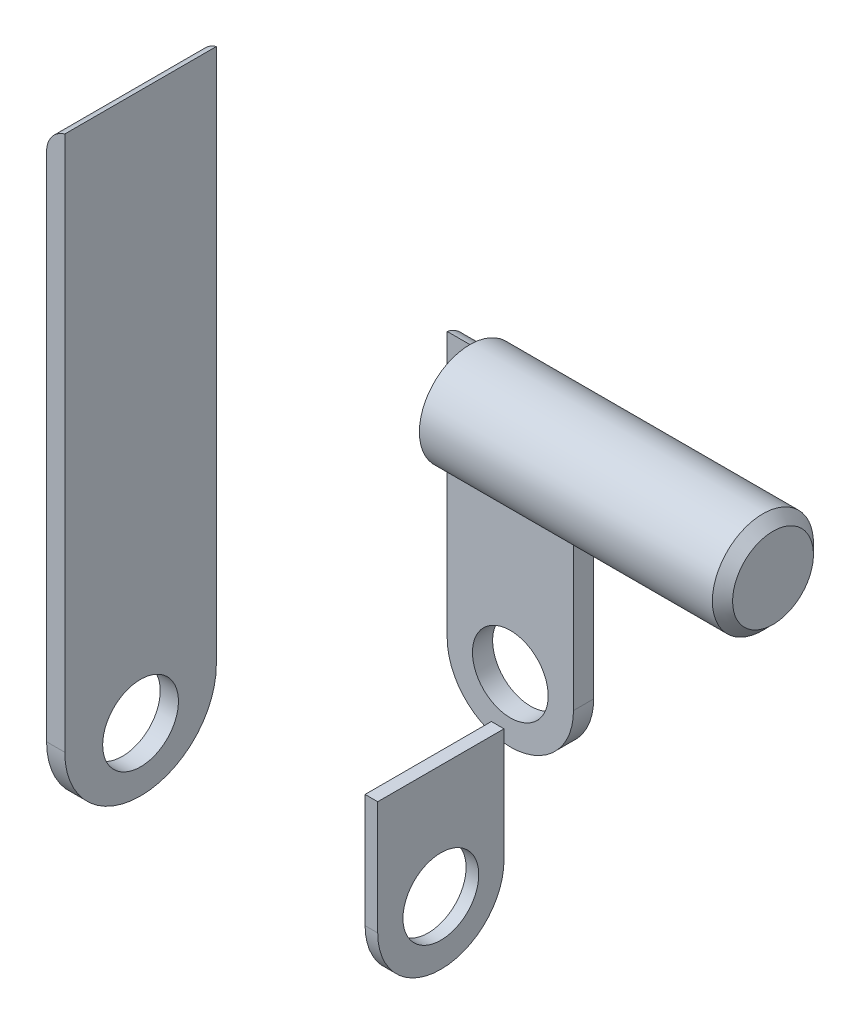
ISO-10303-21;
HEADER;
FILE_DESCRIPTION(('STEP AP214'),'2;1');
FILE_NAME('part.step','',(''),(''),'','','');
FILE_SCHEMA(('AUTOMOTIVE_DESIGN { 1 0 10303 214 1 1 1 1 }'));
ENDSEC;
DATA;
#1=APPLICATION_CONTEXT('core data for automotive mechanical design processes');
#2=APPLICATION_PROTOCOL_DEFINITION('international standard','automotive_design',2000,#1);
#3=PRODUCT_CONTEXT('',#1,'mechanical');
#4=PRODUCT('Part','Part','',(#3));
#5=PRODUCT_RELATED_PRODUCT_CATEGORY('part','',(#4));
#6=PRODUCT_DEFINITION_FORMATION('','',#4);
#7=PRODUCT_DEFINITION_CONTEXT('part definition',#1,'design');
#8=PRODUCT_DEFINITION('design','',#6,#7);
#9=PRODUCT_DEFINITION_SHAPE('','',#8);
#10=(LENGTH_UNIT() NAMED_UNIT(*) SI_UNIT(.MILLI.,.METRE.));
#11=(NAMED_UNIT(*) PLANE_ANGLE_UNIT() SI_UNIT($,.RADIAN.));
#12=(NAMED_UNIT(*) SI_UNIT($,.STERADIAN.) SOLID_ANGLE_UNIT());
#13=UNCERTAINTY_MEASURE_WITH_UNIT(LENGTH_MEASURE(1.E-05),#10,'distance_accuracy_value','');
#14=(GEOMETRIC_REPRESENTATION_CONTEXT(3) GLOBAL_UNCERTAINTY_ASSIGNED_CONTEXT((#13)) GLOBAL_UNIT_ASSIGNED_CONTEXT((#10,
#11,#12)) REPRESENTATION_CONTEXT('',''));
#15=CARTESIAN_POINT('',(0.,0.,0.));
#16=DIRECTION('',(0.,0.,1.));
#17=DIRECTION('',(1.,0.,0.));
#18=AXIS2_PLACEMENT_3D('',#15,#16,#17);
#19=CARTESIAN_POINT('',(-7.825,-7.625,1.25));
#20=DIRECTION('',(-1.,0.,0.));
#21=DIRECTION('',(0.,0.,1.));
#22=AXIS2_PLACEMENT_3D('',#19,#20,#21);
#23=PLANE('',#22);
#24=CARTESIAN_POINT('',(-7.825,-8.75,0.));
#25=DIRECTION('',(-1.,0.,0.));
#26=DIRECTION('',(0.,0.,1.));
#27=AXIS2_PLACEMENT_3D('',#24,#25,#26);
#28=CIRCLE('',#27,0.75);
#29=CARTESIAN_POINT('',(-7.825,-8.75,0.75));
#30=VERTEX_POINT('',#29);
#31=EDGE_CURVE('P0_E20',#30,#30,#28,.F.);
#32=ORIENTED_EDGE('',*,*,#31,.T.);
#33=EDGE_LOOP('',(#32));
#34=FACE_BOUND('',#33,.T.);
#35=CARTESIAN_POINT('',(-7.825,-8.75,0.));
#36=DIRECTION('',(-1.,0.,0.));
#37=DIRECTION('',(0.,0.,1.));
#38=AXIS2_PLACEMENT_3D('',#35,#36,#37);
#39=CIRCLE('',#38,1.25);
#40=CARTESIAN_POINT('',(-7.825,-8.75,1.25));
#41=VERTEX_POINT('',#40);
#42=CARTESIAN_POINT('',(-7.825,-8.75,-1.25));
#43=VERTEX_POINT('',#42);
#44=EDGE_CURVE('P0_E48',#41,#43,#39,.F.);
#45=ORIENTED_EDGE('',*,*,#44,.F.);
#46=DIRECTION('',(0.,1.,0.));
#47=VECTOR('',#46,1.);
#48=CARTESIAN_POINT('',(-7.825,-10.,1.25));
#49=LINE('',#48,#47);
#50=CARTESIAN_POINT('',(-7.825,-6.5,1.25));
#51=VERTEX_POINT('',#50);
#52=EDGE_CURVE('P0_E52',#41,#51,#49,.T.);
#53=ORIENTED_EDGE('',*,*,#52,.T.);
#54=DIRECTION('',(0.,0.,1.));
#55=VECTOR('',#54,1.);
#56=CARTESIAN_POINT('',(-7.825,-6.5,1.25));
#57=LINE('',#56,#55);
#58=CARTESIAN_POINT('',(-7.825,-6.5,-1.25));
#59=VERTEX_POINT('',#58);
#60=EDGE_CURVE('P0_E66',#59,#51,#57,.T.);
#61=ORIENTED_EDGE('',*,*,#60,.F.);
#62=DIRECTION('',(0.,1.,0.));
#63=VECTOR('',#62,1.);
#64=CARTESIAN_POINT('',(-7.825,-10.,-1.25));
#65=LINE('',#64,#63);
#66=EDGE_CURVE('P0_E65',#59,#43,#65,.F.);
#67=ORIENTED_EDGE('',*,*,#66,.T.);
#68=EDGE_LOOP('',(#45,#53,#61,#67));
#69=FACE_BOUND('',#68,.T.);
#70=ADVANCED_FACE('P0_F17',(#34,#69),#23,.T.);
#71=CARTESIAN_POINT('',(-7.825,-8.75,0.));
#72=DIRECTION('',(-1.,0.,0.));
#73=DIRECTION('',(0.,0.,1.));
#74=AXIS2_PLACEMENT_3D('',#71,#72,#73);
#75=CYLINDRICAL_SURFACE('',#74,0.75);
#76=ORIENTED_EDGE('',*,*,#31,.F.);
#77=EDGE_LOOP('',(#76));
#78=FACE_BOUND('',#77,.T.);
#79=CARTESIAN_POINT('',(-7.575,-8.75,0.));
#80=DIRECTION('',(-1.,0.,0.));
#81=DIRECTION('',(0.,0.,1.));
#82=AXIS2_PLACEMENT_3D('',#79,#80,#81);
#83=CIRCLE('',#82,0.75);
#84=CARTESIAN_POINT('',(-7.575,-8.75,0.75));
#85=VERTEX_POINT('',#84);
#86=EDGE_CURVE('P0_E76',#85,#85,#83,.T.);
#87=ORIENTED_EDGE('',*,*,#86,.F.);
#88=EDGE_LOOP('',(#87));
#89=FACE_BOUND('',#88,.T.);
#90=ADVANCED_FACE('P0_F115',(#78,#89),#75,.F.);
#91=CARTESIAN_POINT('',(-7.7,-6.5,1.25));
#92=DIRECTION('',(0.,1.,0.));
#93=DIRECTION('',(0.,0.,1.));
#94=AXIS2_PLACEMENT_3D('',#91,#92,#93);
#95=PLANE('',#94);
#96=ORIENTED_EDGE('',*,*,#60,.T.);
#97=DIRECTION('',(-1.,0.,0.));
#98=VECTOR('',#97,1.);
#99=CARTESIAN_POINT('',(-7.825,-6.5,1.25));
#100=LINE('',#99,#98);
#101=CARTESIAN_POINT('',(-7.575,-6.5,1.25));
#102=VERTEX_POINT('',#101);
#103=EDGE_CURVE('P0_E73',#51,#102,#100,.F.);
#104=ORIENTED_EDGE('',*,*,#103,.T.);
#105=DIRECTION('',(0.,0.,-1.));
#106=VECTOR('',#105,1.);
#107=CARTESIAN_POINT('',(-7.575,-6.5,1.25));
#108=LINE('',#107,#106);
#109=CARTESIAN_POINT('',(-7.575,-6.5,-1.25));
#110=VERTEX_POINT('',#109);
#111=EDGE_CURVE('P0_E62',#110,#102,#108,.F.);
#112=ORIENTED_EDGE('',*,*,#111,.F.);
#113=DIRECTION('',(1.,0.,0.));
#114=VECTOR('',#113,1.);
#115=CARTESIAN_POINT('',(-7.825,-6.5,-1.25));
#116=LINE('',#115,#114);
#117=EDGE_CURVE('P0_E68',#110,#59,#116,.F.);
#118=ORIENTED_EDGE('',*,*,#117,.T.);
#119=EDGE_LOOP('',(#96,#104,#112,#118));
#120=FACE_BOUND('',#119,.T.);
#121=ADVANCED_FACE('P0_F113',(#120),#95,.T.);
#122=CARTESIAN_POINT('',(-7.825,-10.,1.25));
#123=DIRECTION('',(0.,0.,-1.));
#124=DIRECTION('',(-1.,0.,0.));
#125=AXIS2_PLACEMENT_3D('',#122,#123,#124);
#126=PLANE('',#125);
#127=DIRECTION('',(0.,1.,0.));
#128=VECTOR('',#127,1.);
#129=CARTESIAN_POINT('',(-7.575,-7.625,1.25));
#130=LINE('',#129,#128);
#131=CARTESIAN_POINT('',(-7.575,-8.75,1.25));
#132=VERTEX_POINT('',#131);
#133=EDGE_CURVE('P0_E88',#102,#132,#130,.F.);
#134=ORIENTED_EDGE('',*,*,#133,.F.);
#135=ORIENTED_EDGE('',*,*,#103,.F.);
#136=ORIENTED_EDGE('',*,*,#52,.F.);
#137=DIRECTION('',(-1.,0.,0.));
#138=VECTOR('',#137,1.);
#139=CARTESIAN_POINT('',(-7.575,-8.75,1.25));
#140=LINE('',#139,#138);
#141=EDGE_CURVE('P0_E72',#132,#41,#140,.T.);
#142=ORIENTED_EDGE('',*,*,#141,.F.);
#143=EDGE_LOOP('',(#134,#135,#136,#142));
#144=FACE_BOUND('',#143,.T.);
#145=ADVANCED_FACE('P0_F112',(#144),#126,.F.);
#146=CARTESIAN_POINT('',(-7.575,-8.75,0.));
#147=DIRECTION('',(-1.,0.,0.));
#148=DIRECTION('',(0.,0.,1.));
#149=AXIS2_PLACEMENT_3D('',#146,#147,#148);
#150=CYLINDRICAL_SURFACE('',#149,1.25);
#151=CARTESIAN_POINT('',(-7.575,-8.75,0.));
#152=DIRECTION('',(-1.,0.,0.));
#153=DIRECTION('',(0.,0.,1.));
#154=AXIS2_PLACEMENT_3D('',#151,#152,#153);
#155=CIRCLE('',#154,1.25);
#156=CARTESIAN_POINT('',(-7.575,-8.75,-1.25));
#157=VERTEX_POINT('',#156);
#158=EDGE_CURVE('P0_E26',#132,#157,#155,.F.);
#159=ORIENTED_EDGE('',*,*,#158,.F.);
#160=ORIENTED_EDGE('',*,*,#141,.T.);
#161=ORIENTED_EDGE('',*,*,#44,.T.);
#162=DIRECTION('',(1.,0.,0.));
#163=VECTOR('',#162,1.);
#164=CARTESIAN_POINT('',(-7.825,-8.75,-1.25));
#165=LINE('',#164,#163);
#166=EDGE_CURVE('P0_E35',#43,#157,#165,.T.);
#167=ORIENTED_EDGE('',*,*,#166,.T.);
#168=EDGE_LOOP('',(#159,#160,#161,#167));
#169=FACE_BOUND('',#168,.T.);
#170=ADVANCED_FACE('P0_F71',(#169),#150,.T.);
#171=CARTESIAN_POINT('',(-7.825,-10.,-1.25));
#172=DIRECTION('',(0.,0.,1.));
#173=DIRECTION('',(1.,0.,0.));
#174=AXIS2_PLACEMENT_3D('',#171,#172,#173);
#175=PLANE('',#174);
#176=ORIENTED_EDGE('',*,*,#66,.F.);
#177=ORIENTED_EDGE('',*,*,#117,.F.);
#178=DIRECTION('',(0.,1.,0.));
#179=VECTOR('',#178,1.);
#180=CARTESIAN_POINT('',(-7.575,-7.625,-1.25));
#181=LINE('',#180,#179);
#182=EDGE_CURVE('P0_E11',#157,#110,#181,.T.);
#183=ORIENTED_EDGE('',*,*,#182,.F.);
#184=ORIENTED_EDGE('',*,*,#166,.F.);
#185=EDGE_LOOP('',(#176,#177,#183,#184));
#186=FACE_BOUND('',#185,.T.);
#187=ADVANCED_FACE('P0_F74',(#186),#175,.F.);
#188=CARTESIAN_POINT('',(-7.575,-7.625,1.25));
#189=DIRECTION('',(1.,0.,0.));
#190=DIRECTION('',(0.,0.,-1.));
#191=AXIS2_PLACEMENT_3D('',#188,#189,#190);
#192=PLANE('',#191);
#193=ORIENTED_EDGE('',*,*,#158,.T.);
#194=ORIENTED_EDGE('',*,*,#182,.T.);
#195=ORIENTED_EDGE('',*,*,#111,.T.);
#196=ORIENTED_EDGE('',*,*,#133,.T.);
#197=EDGE_LOOP('',(#193,#194,#195,#196));
#198=FACE_BOUND('',#197,.T.);
#199=ORIENTED_EDGE('',*,*,#86,.T.);
#200=EDGE_LOOP('',(#199));
#201=FACE_BOUND('',#200,.T.);
#202=ADVANCED_FACE('P0_F108',(#198,#201),#192,.T.);
#203=CLOSED_SHELL('',(#70,#90,#121,#145,#170,#187,#202));
#204=MANIFOLD_SOLID_BREP('P0_B1',#203);
#205=CARTESIAN_POINT('',(-1.,0.,0.));
#206=DIRECTION('',(1.,0.,0.));
#207=DIRECTION('',(0.,0.,-1.));
#208=AXIS2_PLACEMENT_3D('',#205,#206,#207);
#209=PLANE('',#208);
#210=CARTESIAN_POINT('',(-0.999999999976353,0.,0.));
#211=DIRECTION('',(-1.,0.,0.));
#212=DIRECTION('',(0.,0.,1.));
#213=AXIS2_PLACEMENT_3D('',#210,#211,#212);
#214=CIRCLE('',#213,0.799999999969714);
#215=CARTESIAN_POINT('',(-0.999999999976353,0.,0.799999999969714));
#216=VERTEX_POINT('',#215);
#217=EDGE_CURVE('P1_E18',#216,#216,#214,.T.);
#218=ORIENTED_EDGE('',*,*,#217,.F.);
#219=EDGE_LOOP('',(#218));
#220=FACE_BOUND('',#219,.T.);
#221=ADVANCED_FACE('P1_F15',(#220),#209,.T.);
#222=CARTESIAN_POINT('',(-7.,0.,0.));
#223=DIRECTION('',(1.,0.,0.));
#224=DIRECTION('',(0.,0.,-1.));
#225=AXIS2_PLACEMENT_3D('',#222,#223,#224);
#226=PLANE('',#225);
#227=CARTESIAN_POINT('',(-7.,0.,0.));
#228=DIRECTION('',(-1.,0.,0.));
#229=DIRECTION('',(0.,0.,1.));
#230=AXIS2_PLACEMENT_3D('',#227,#228,#229);
#231=CIRCLE('',#230,1.);
#232=CARTESIAN_POINT('',(-7.,0.,1.));
#233=VERTEX_POINT('',#232);
#234=EDGE_CURVE('P1_E22',#233,#233,#231,.F.);
#235=ORIENTED_EDGE('',*,*,#234,.F.);
#236=EDGE_LOOP('',(#235));
#237=FACE_BOUND('',#236,.T.);
#238=ADVANCED_FACE('P1_F35',(#237),#226,.F.);
#239=CARTESIAN_POINT('',(-1.19999999992615,0.,0.));
#240=DIRECTION('',(-1.,0.,0.));
#241=DIRECTION('',(0.,0.,1.));
#242=AXIS2_PLACEMENT_3D('',#239,#240,#241);
#243=CONICAL_SURFACE('',#242,0.99999999991951,0.785398163397448);
#244=CARTESIAN_POINT('',(-1.2,0.,0.));
#245=DIRECTION('',(-1.,0.,0.));
#246=DIRECTION('',(0.,0.,1.));
#247=AXIS2_PLACEMENT_3D('',#244,#245,#246);
#248=CIRCLE('',#247,1.);
#249=CARTESIAN_POINT('',(-1.2,0.,1.));
#250=VERTEX_POINT('',#249);
#251=EDGE_CURVE('P1_E10',#250,#250,#248,.T.);
#252=ORIENTED_EDGE('',*,*,#251,.F.);
#253=EDGE_LOOP('',(#252));
#254=FACE_BOUND('',#253,.T.);
#255=ORIENTED_EDGE('',*,*,#217,.T.);
#256=EDGE_LOOP('',(#255));
#257=FACE_BOUND('',#256,.T.);
#258=ADVANCED_FACE('P1_F32',(#254,#257),#243,.T.);
#259=CARTESIAN_POINT('',(-1.2,0.,0.));
#260=DIRECTION('',(-1.,0.,0.));
#261=DIRECTION('',(0.,0.,1.));
#262=AXIS2_PLACEMENT_3D('',#259,#260,#261);
#263=CYLINDRICAL_SURFACE('',#262,1.);
#264=ORIENTED_EDGE('',*,*,#234,.T.);
#265=EDGE_LOOP('',(#264));
#266=FACE_BOUND('',#265,.T.);
#267=ORIENTED_EDGE('',*,*,#251,.T.);
#268=EDGE_LOOP('',(#267));
#269=FACE_BOUND('',#268,.T.);
#270=ADVANCED_FACE('P1_F41',(#266,#269),#263,.T.);
#271=CLOSED_SHELL('',(#221,#238,#258,#270));
#272=MANIFOLD_SOLID_BREP('P1_B1',#271);
#273=CARTESIAN_POINT('',(-11.95,-6.36994897495,-4.9));
#274=DIRECTION('',(0.,0.,-1.));
#275=DIRECTION('',(-1.,0.,0.));
#276=AXIS2_PLACEMENT_3D('',#273,#274,#275);
#277=PLANE('',#276);
#278=CARTESIAN_POINT('',(-10.7,-8.75,-4.9));
#279=DIRECTION('',(0.,0.,1.));
#280=DIRECTION('',(1.,0.,0.));
#281=AXIS2_PLACEMENT_3D('',#278,#279,#280);
#282=CIRCLE('',#281,0.75);
#283=CARTESIAN_POINT('',(-9.95,-8.75,-4.9));
#284=VERTEX_POINT('',#283);
#285=EDGE_CURVE('P2_E74',#284,#284,#282,.T.);
#286=ORIENTED_EDGE('',*,*,#285,.T.);
#287=EDGE_LOOP('',(#286));
#288=FACE_BOUND('',#287,.T.);
#289=CARTESIAN_POINT('',(-10.7,-8.75,-4.9));
#290=DIRECTION('',(0.,0.,-1.));
#291=DIRECTION('',(-1.,0.,0.));
#292=AXIS2_PLACEMENT_3D('',#289,#290,#291);
#293=CIRCLE('',#292,1.25);
#294=CARTESIAN_POINT('',(-11.95,-8.75,-4.9));
#295=VERTEX_POINT('',#294);
#296=CARTESIAN_POINT('',(-9.45,-8.75,-4.9));
#297=VERTEX_POINT('',#296);
#298=EDGE_CURVE('P2_E70',#295,#297,#293,.F.);
#299=ORIENTED_EDGE('',*,*,#298,.F.);
#300=DIRECTION('',(0.,1.,0.));
#301=VECTOR('',#300,1.);
#302=CARTESIAN_POINT('',(-11.95,-10.,-4.9));
#303=LINE('',#302,#301);
#304=CARTESIAN_POINT('',(-11.95,-3.98989794945,-4.9));
#305=VERTEX_POINT('',#304);
#306=EDGE_CURVE('P2_E60',#295,#305,#303,.T.);
#307=ORIENTED_EDGE('',*,*,#306,.T.);
#308=DIRECTION('',(-1.,0.,0.));
#309=VECTOR('',#308,1.);
#310=CARTESIAN_POINT('',(-11.95,-3.9898979499,-4.9));
#311=LINE('',#310,#309);
#312=CARTESIAN_POINT('',(-9.45,-3.98989794945,-4.9));
#313=VERTEX_POINT('',#312);
#314=EDGE_CURVE('P2_E20',#313,#305,#311,.T.);
#315=ORIENTED_EDGE('',*,*,#314,.F.);
#316=DIRECTION('',(0.,1.,0.));
#317=VECTOR('',#316,1.);
#318=CARTESIAN_POINT('',(-9.45,-10.,-4.9));
#319=LINE('',#318,#317);
#320=EDGE_CURVE('P2_E59',#313,#297,#319,.F.);
#321=ORIENTED_EDGE('',*,*,#320,.T.);
#322=EDGE_LOOP('',(#299,#307,#315,#321));
#323=FACE_BOUND('',#322,.T.);
#324=ADVANCED_FACE('P2_F17',(#288,#323),#277,.T.);
#325=CARTESIAN_POINT('',(-11.95,-3.989897949,-4.4));
#326=DIRECTION('',(1.,0.,0.));
#327=DIRECTION('',(0.,0.,-1.));
#328=AXIS2_PLACEMENT_3D('',#325,#326,#327);
#329=CYLINDRICAL_SURFACE('',#328,0.5);
#330=DIRECTION('',(1.,0.,0.));
#331=VECTOR('',#330,1.);
#332=CARTESIAN_POINT('',(-11.95,-3.500000000294,-4.5));
#333=LINE('',#332,#331);
#334=CARTESIAN_POINT('',(-9.45,-3.50000000036868,-4.5));
#335=VERTEX_POINT('',#334);
#336=CARTESIAN_POINT('',(-11.95,-3.50000000036868,-4.5));
#337=VERTEX_POINT('',#336);
#338=EDGE_CURVE('P2_E67',#335,#337,#333,.F.);
#339=ORIENTED_EDGE('',*,*,#338,.F.);
#340=CARTESIAN_POINT('',(-9.45,-3.989897949,-4.4));
#341=DIRECTION('',(1.,0.,0.));
#342=DIRECTION('',(0.,0.,-1.));
#343=AXIS2_PLACEMENT_3D('',#340,#341,#342);
#344=CIRCLE('',#343,0.5);
#345=EDGE_CURVE('P2_E64',#335,#313,#344,.F.);
#346=ORIENTED_EDGE('',*,*,#345,.T.);
#347=ORIENTED_EDGE('',*,*,#314,.T.);
#348=CARTESIAN_POINT('',(-11.95,-3.989897949,-4.4));
#349=DIRECTION('',(1.,0.,0.));
#350=DIRECTION('',(0.,0.,-1.));
#351=AXIS2_PLACEMENT_3D('',#348,#349,#350);
#352=CIRCLE('',#351,0.5);
#353=EDGE_CURVE('P2_E84',#305,#337,#352,.T.);
#354=ORIENTED_EDGE('',*,*,#353,.T.);
#355=EDGE_LOOP('',(#339,#346,#347,#354));
#356=FACE_BOUND('',#355,.T.);
#357=ADVANCED_FACE('P2_F65',(#356),#329,.T.);
#358=CARTESIAN_POINT('',(-11.95,-10.,-4.5));
#359=DIRECTION('',(1.,0.,0.));
#360=DIRECTION('',(0.,0.,-1.));
#361=AXIS2_PLACEMENT_3D('',#358,#359,#360);
#362=PLANE('',#361);
#363=DIRECTION('',(0.,1.,0.));
#364=VECTOR('',#363,1.);
#365=CARTESIAN_POINT('',(-11.95,-6.125000000067,-4.5));
#366=LINE('',#365,#364);
#367=CARTESIAN_POINT('',(-11.95,-8.75,-4.5));
#368=VERTEX_POINT('',#367);
#369=EDGE_CURVE('P2_E77',#337,#368,#366,.F.);
#370=ORIENTED_EDGE('',*,*,#369,.F.);
#371=ORIENTED_EDGE('',*,*,#353,.F.);
#372=ORIENTED_EDGE('',*,*,#306,.F.);
#373=DIRECTION('',(0.,0.,-1.));
#374=VECTOR('',#373,1.);
#375=CARTESIAN_POINT('',(-11.95,-8.75,-4.5));
#376=LINE('',#375,#374);
#377=EDGE_CURVE('P2_E81',#368,#295,#376,.T.);
#378=ORIENTED_EDGE('',*,*,#377,.F.);
#379=EDGE_LOOP('',(#370,#371,#372,#378));
#380=FACE_BOUND('',#379,.T.);
#381=ADVANCED_FACE('P2_F94',(#380),#362,.F.);
#382=CARTESIAN_POINT('',(-10.7,-8.75,-4.5));
#383=DIRECTION('',(0.,0.,-1.));
#384=DIRECTION('',(-1.,0.,0.));
#385=AXIS2_PLACEMENT_3D('',#382,#383,#384);
#386=CYLINDRICAL_SURFACE('',#385,1.25);
#387=ORIENTED_EDGE('',*,*,#298,.T.);
#388=DIRECTION('',(0.,0.,1.));
#389=VECTOR('',#388,1.);
#390=CARTESIAN_POINT('',(-9.45,-8.75,-4.5));
#391=LINE('',#390,#389);
#392=CARTESIAN_POINT('',(-9.45,-8.75,-4.5));
#393=VERTEX_POINT('',#392);
#394=EDGE_CURVE('P2_E35',#297,#393,#391,.T.);
#395=ORIENTED_EDGE('',*,*,#394,.T.);
#396=CARTESIAN_POINT('',(-10.7,-8.75,-4.5));
#397=DIRECTION('',(0.,0.,-1.));
#398=DIRECTION('',(-1.,0.,0.));
#399=AXIS2_PLACEMENT_3D('',#396,#397,#398);
#400=CIRCLE('',#399,1.25);
#401=EDGE_CURVE('P2_E86',#368,#393,#400,.F.);
#402=ORIENTED_EDGE('',*,*,#401,.F.);
#403=ORIENTED_EDGE('',*,*,#377,.T.);
#404=EDGE_LOOP('',(#387,#395,#402,#403));
#405=FACE_BOUND('',#404,.T.);
#406=ADVANCED_FACE('P2_F97',(#405),#386,.T.);
#407=CARTESIAN_POINT('',(-9.45,-10.,-4.5));
#408=DIRECTION('',(-1.,0.,0.));
#409=DIRECTION('',(0.,0.,1.));
#410=AXIS2_PLACEMENT_3D('',#407,#408,#409);
#411=PLANE('',#410);
#412=ORIENTED_EDGE('',*,*,#320,.F.);
#413=ORIENTED_EDGE('',*,*,#345,.F.);
#414=DIRECTION('',(0.,1.,0.));
#415=VECTOR('',#414,1.);
#416=CARTESIAN_POINT('',(-9.45,-6.125000000067,-4.5));
#417=LINE('',#416,#415);
#418=EDGE_CURVE('P2_E26',#393,#335,#417,.T.);
#419=ORIENTED_EDGE('',*,*,#418,.F.);
#420=ORIENTED_EDGE('',*,*,#394,.F.);
#421=EDGE_LOOP('',(#412,#413,#419,#420));
#422=FACE_BOUND('',#421,.T.);
#423=ADVANCED_FACE('P2_F72',(#422),#411,.F.);
#424=CARTESIAN_POINT('',(-10.7,-8.75,-4.5));
#425=DIRECTION('',(0.,0.,1.));
#426=DIRECTION('',(1.,0.,0.));
#427=AXIS2_PLACEMENT_3D('',#424,#425,#426);
#428=CYLINDRICAL_SURFACE('',#427,0.75);
#429=CARTESIAN_POINT('',(-10.7,-8.75,-4.5));
#430=DIRECTION('',(0.,0.,1.));
#431=DIRECTION('',(1.,0.,0.));
#432=AXIS2_PLACEMENT_3D('',#429,#430,#431);
#433=CIRCLE('',#432,0.75);
#434=CARTESIAN_POINT('',(-9.95,-8.75,-4.5));
#435=VERTEX_POINT('',#434);
#436=EDGE_CURVE('P2_E11',#435,#435,#433,.F.);
#437=ORIENTED_EDGE('',*,*,#436,.F.);
#438=EDGE_LOOP('',(#437));
#439=FACE_BOUND('',#438,.T.);
#440=ORIENTED_EDGE('',*,*,#285,.F.);
#441=EDGE_LOOP('',(#440));
#442=FACE_BOUND('',#441,.T.);
#443=ADVANCED_FACE('P2_F105',(#439,#442),#428,.F.);
#444=CARTESIAN_POINT('',(-11.95,-6.125000000067,-4.5));
#445=DIRECTION('',(0.,0.,1.));
#446=DIRECTION('',(1.,0.,0.));
#447=AXIS2_PLACEMENT_3D('',#444,#445,#446);
#448=PLANE('',#447);
#449=ORIENTED_EDGE('',*,*,#436,.T.);
#450=EDGE_LOOP('',(#449));
#451=FACE_BOUND('',#450,.T.);
#452=ORIENTED_EDGE('',*,*,#401,.T.);
#453=ORIENTED_EDGE('',*,*,#418,.T.);
#454=ORIENTED_EDGE('',*,*,#338,.T.);
#455=ORIENTED_EDGE('',*,*,#369,.T.);
#456=EDGE_LOOP('',(#452,#453,#454,#455));
#457=FACE_BOUND('',#456,.T.);
#458=ADVANCED_FACE('P2_F96',(#451,#457),#448,.T.);
#459=CLOSED_SHELL('',(#324,#357,#381,#406,#423,#443,#458));
#460=MANIFOLD_SOLID_BREP('P2_B1',#459);
#461=CARTESIAN_POINT('',(-13.88,-10.,0.));
#462=DIRECTION('',(-1.,0.,0.));
#463=DIRECTION('',(0.,0.,1.));
#464=AXIS2_PLACEMENT_3D('',#461,#462,#463);
#465=PLANE('',#464);
#466=CARTESIAN_POINT('',(-13.88,-8.75,0.));
#467=DIRECTION('',(-1.,0.,0.));
#468=DIRECTION('',(0.,0.,1.));
#469=AXIS2_PLACEMENT_3D('',#466,#467,#468);
#470=CIRCLE('',#469,0.75);
#471=CARTESIAN_POINT('',(-13.88,-8.75,0.75));
#472=VERTEX_POINT('',#471);
#473=EDGE_CURVE('P3_E77',#472,#472,#470,.F.);
#474=ORIENTED_EDGE('',*,*,#473,.T.);
#475=EDGE_LOOP('',(#474));
#476=FACE_BOUND('',#475,.T.);
#477=DIRECTION('',(0.,1.,0.));
#478=VECTOR('',#477,1.);
#479=CARTESIAN_POINT('',(-13.88,-10.,-1.5));
#480=LINE('',#479,#478);
#481=CARTESIAN_POINT('',(-13.88,1.62,-1.5));
#482=VERTEX_POINT('',#481);
#483=CARTESIAN_POINT('',(-13.88,-8.5,-1.5));
#484=VERTEX_POINT('',#483);
#485=EDGE_CURVE('P3_E61',#482,#484,#480,.F.);
#486=ORIENTED_EDGE('',*,*,#485,.T.);
#487=CARTESIAN_POINT('',(-13.88,-8.5,0.));
#488=DIRECTION('',(-1.,0.,0.));
#489=DIRECTION('',(0.,0.,1.));
#490=AXIS2_PLACEMENT_3D('',#487,#488,#489);
#491=CIRCLE('',#490,1.5);
#492=CARTESIAN_POINT('',(-13.88,-8.5,1.5));
#493=VERTEX_POINT('',#492);
#494=EDGE_CURVE('P3_E85',#493,#484,#491,.F.);
#495=ORIENTED_EDGE('',*,*,#494,.F.);
#496=DIRECTION('',(0.,1.,0.));
#497=VECTOR('',#496,1.);
#498=CARTESIAN_POINT('',(-13.88,-10.,1.5));
#499=LINE('',#498,#497);
#500=CARTESIAN_POINT('',(-13.88,1.62,1.5));
#501=VERTEX_POINT('',#500);
#502=EDGE_CURVE('P3_E64',#493,#501,#499,.T.);
#503=ORIENTED_EDGE('',*,*,#502,.T.);
#504=DIRECTION('',(0.,0.,1.));
#505=VECTOR('',#504,1.);
#506=CARTESIAN_POINT('',(-13.88,1.62,-1.5));
#507=LINE('',#506,#505);
#508=EDGE_CURVE('P3_E65',#482,#501,#507,.T.);
#509=ORIENTED_EDGE('',*,*,#508,.F.);
#510=EDGE_LOOP('',(#486,#495,#503,#509));
#511=FACE_BOUND('',#510,.T.);
#512=ADVANCED_FACE('P3_F16',(#476,#511),#465,.T.);
#513=CARTESIAN_POINT('',(-13.88,-10.,-1.5));
#514=DIRECTION('',(0.,0.,1.));
#515=DIRECTION('',(1.,0.,0.));
#516=AXIS2_PLACEMENT_3D('',#513,#514,#515);
#517=PLANE('',#516);
#518=CARTESIAN_POINT('',(-13.38,1.62,-1.5));
#519=DIRECTION('',(0.,0.,1.));
#520=DIRECTION('',(1.,0.,0.));
#521=AXIS2_PLACEMENT_3D('',#518,#519,#520);
#522=CIRCLE('',#521,0.5);
#523=CARTESIAN_POINT('',(-13.52,2.1,-1.5));
#524=VERTEX_POINT('',#523);
#525=EDGE_CURVE('P3_E19',#524,#482,#522,.T.);
#526=ORIENTED_EDGE('',*,*,#525,.F.);
#527=DIRECTION('',(0.,1.,0.));
#528=VECTOR('',#527,1.);
#529=CARTESIAN_POINT('',(-13.52,-10.,-1.5));
#530=LINE('',#529,#528);
#531=CARTESIAN_POINT('',(-13.52,-8.5,-1.5));
#532=VERTEX_POINT('',#531);
#533=EDGE_CURVE('P3_E59',#532,#524,#530,.T.);
#534=ORIENTED_EDGE('',*,*,#533,.F.);
#535=DIRECTION('',(-1.,0.,0.));
#536=VECTOR('',#535,1.);
#537=CARTESIAN_POINT('',(-13.52,-8.5,-1.5));
#538=LINE('',#537,#536);
#539=EDGE_CURVE('P3_E83',#484,#532,#538,.F.);
#540=ORIENTED_EDGE('',*,*,#539,.F.);
#541=ORIENTED_EDGE('',*,*,#485,.F.);
#542=EDGE_LOOP('',(#526,#534,#540,#541));
#543=FACE_BOUND('',#542,.T.);
#544=ADVANCED_FACE('P3_F56',(#543),#517,.F.);
#545=CARTESIAN_POINT('',(-13.38,1.62,-1.5));
#546=DIRECTION('',(0.,0.,1.));
#547=DIRECTION('',(1.,0.,0.));
#548=AXIS2_PLACEMENT_3D('',#545,#546,#547);
#549=CYLINDRICAL_SURFACE('',#548,0.5);
#550=DIRECTION('',(0.,0.,-1.));
#551=VECTOR('',#550,1.);
#552=CARTESIAN_POINT('',(-13.52,2.1,0.));
#553=LINE('',#552,#551);
#554=CARTESIAN_POINT('',(-13.52,2.1,1.5));
#555=VERTEX_POINT('',#554);
#556=EDGE_CURVE('P3_E67',#524,#555,#553,.F.);
#557=ORIENTED_EDGE('',*,*,#556,.F.);
#558=ORIENTED_EDGE('',*,*,#525,.T.);
#559=ORIENTED_EDGE('',*,*,#508,.T.);
#560=CARTESIAN_POINT('',(-13.38,1.62,1.5));
#561=DIRECTION('',(0.,0.,1.));
#562=DIRECTION('',(1.,0.,0.));
#563=AXIS2_PLACEMENT_3D('',#560,#561,#562);
#564=CIRCLE('',#563,0.5);
#565=EDGE_CURVE('P3_E70',#501,#555,#564,.F.);
#566=ORIENTED_EDGE('',*,*,#565,.T.);
#567=EDGE_LOOP('',(#557,#558,#559,#566));
#568=FACE_BOUND('',#567,.T.);
#569=ADVANCED_FACE('P3_F68',(#568),#549,.T.);
#570=CARTESIAN_POINT('',(-13.88,-10.,1.5));
#571=DIRECTION('',(0.,0.,-1.));
#572=DIRECTION('',(-1.,0.,0.));
#573=AXIS2_PLACEMENT_3D('',#570,#571,#572);
#574=PLANE('',#573);
#575=ORIENTED_EDGE('',*,*,#565,.F.);
#576=ORIENTED_EDGE('',*,*,#502,.F.);
#577=DIRECTION('',(-1.,0.,0.));
#578=VECTOR('',#577,1.);
#579=CARTESIAN_POINT('',(-13.52,-8.5,1.5));
#580=LINE('',#579,#578);
#581=CARTESIAN_POINT('',(-13.52,-8.5,1.5));
#582=VERTEX_POINT('',#581);
#583=EDGE_CURVE('P3_E34',#582,#493,#580,.T.);
#584=ORIENTED_EDGE('',*,*,#583,.F.);
#585=DIRECTION('',(0.,1.,0.));
#586=VECTOR('',#585,1.);
#587=CARTESIAN_POINT('',(-13.52,-10.,1.5));
#588=LINE('',#587,#586);
#589=EDGE_CURVE('P3_E73',#555,#582,#588,.F.);
#590=ORIENTED_EDGE('',*,*,#589,.F.);
#591=EDGE_LOOP('',(#575,#576,#584,#590));
#592=FACE_BOUND('',#591,.T.);
#593=ADVANCED_FACE('P3_F96',(#592),#574,.F.);
#594=CARTESIAN_POINT('',(-13.52,-8.5,0.));
#595=DIRECTION('',(-1.,0.,0.));
#596=DIRECTION('',(0.,0.,1.));
#597=AXIS2_PLACEMENT_3D('',#594,#595,#596);
#598=CYLINDRICAL_SURFACE('',#597,1.5);
#599=CARTESIAN_POINT('',(-13.52,-8.5,0.));
#600=DIRECTION('',(-1.,0.,0.));
#601=DIRECTION('',(0.,0.,1.));
#602=AXIS2_PLACEMENT_3D('',#599,#600,#601);
#603=CIRCLE('',#602,1.5);
#604=EDGE_CURVE('P3_E25',#582,#532,#603,.F.);
#605=ORIENTED_EDGE('',*,*,#604,.F.);
#606=ORIENTED_EDGE('',*,*,#583,.T.);
#607=ORIENTED_EDGE('',*,*,#494,.T.);
#608=ORIENTED_EDGE('',*,*,#539,.T.);
#609=EDGE_LOOP('',(#605,#606,#607,#608));
#610=FACE_BOUND('',#609,.T.);
#611=ADVANCED_FACE('P3_F93',(#610),#598,.T.);
#612=CARTESIAN_POINT('',(-13.88,-8.75,0.));
#613=DIRECTION('',(-1.,0.,0.));
#614=DIRECTION('',(0.,0.,1.));
#615=AXIS2_PLACEMENT_3D('',#612,#613,#614);
#616=CYLINDRICAL_SURFACE('',#615,0.75);
#617=CARTESIAN_POINT('',(-13.52,-8.75,0.));
#618=DIRECTION('',(-1.,0.,0.));
#619=DIRECTION('',(0.,0.,1.));
#620=AXIS2_PLACEMENT_3D('',#617,#618,#619);
#621=CIRCLE('',#620,0.75);
#622=CARTESIAN_POINT('',(-13.52,-8.75,0.75));
#623=VERTEX_POINT('',#622);
#624=EDGE_CURVE('P3_E10',#623,#623,#621,.T.);
#625=ORIENTED_EDGE('',*,*,#624,.F.);
#626=EDGE_LOOP('',(#625));
#627=FACE_BOUND('',#626,.T.);
#628=ORIENTED_EDGE('',*,*,#473,.F.);
#629=EDGE_LOOP('',(#628));
#630=FACE_BOUND('',#629,.T.);
#631=ADVANCED_FACE('P3_F104',(#627,#630),#616,.F.);
#632=CARTESIAN_POINT('',(-13.52,-10.,0.));
#633=DIRECTION('',(1.,0.,0.));
#634=DIRECTION('',(0.,0.,-1.));
#635=AXIS2_PLACEMENT_3D('',#632,#633,#634);
#636=PLANE('',#635);
#637=ORIENTED_EDGE('',*,*,#624,.T.);
#638=EDGE_LOOP('',(#637));
#639=FACE_BOUND('',#638,.T.);
#640=ORIENTED_EDGE('',*,*,#589,.T.);
#641=ORIENTED_EDGE('',*,*,#604,.T.);
#642=ORIENTED_EDGE('',*,*,#533,.T.);
#643=ORIENTED_EDGE('',*,*,#556,.T.);
#644=EDGE_LOOP('',(#640,#641,#642,#643));
#645=FACE_BOUND('',#644,.T.);
#646=ADVANCED_FACE('P3_F76',(#639,#645),#636,.T.);
#647=CLOSED_SHELL('',(#512,#544,#569,#593,#611,#631,#646));
#648=MANIFOLD_SOLID_BREP('P3_B1',#647);
#649=ADVANCED_BREP_SHAPE_REPRESENTATION('',(#18,#204,#272,#460,#648),#14);
#650=SHAPE_DEFINITION_REPRESENTATION(#9,#649);
ENDSEC;
END-ISO-10303-21;
